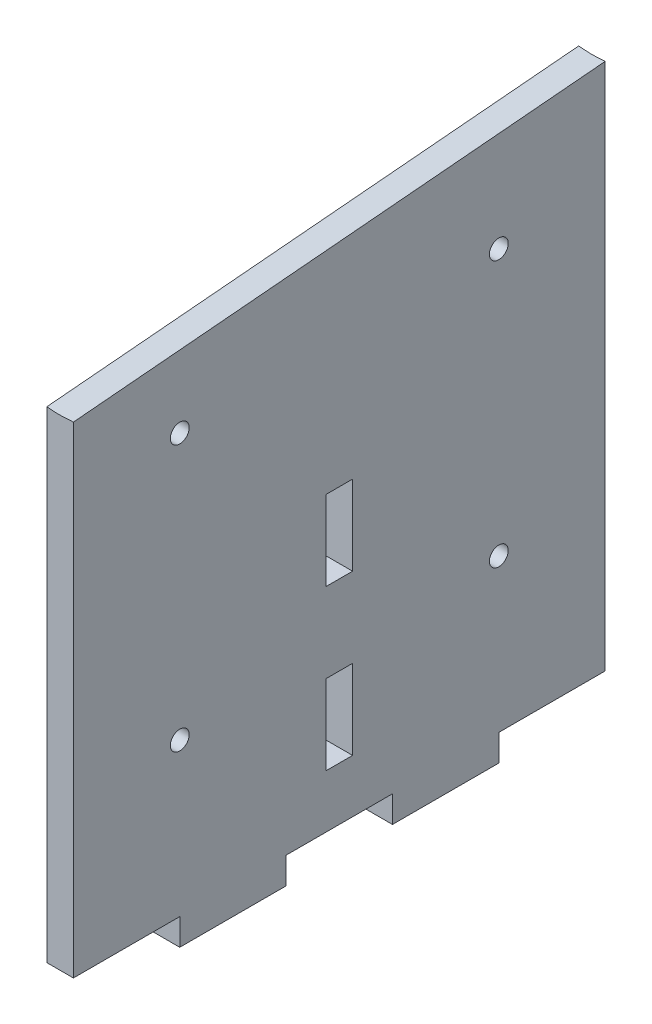
ISO-10303-21;
HEADER;
FILE_DESCRIPTION(('STEP AP214'),'2;1');
FILE_NAME('part.step','',(''),(''),'','','');
FILE_SCHEMA(('AUTOMOTIVE_DESIGN { 1 0 10303 214 1 1 1 1 }'));
ENDSEC;
DATA;
#1=APPLICATION_CONTEXT('core data for automotive mechanical design processes');
#2=APPLICATION_PROTOCOL_DEFINITION('international standard','automotive_design',2000,#1);
#3=PRODUCT_CONTEXT('',#1,'mechanical');
#4=PRODUCT('Part','Part','',(#3));
#5=PRODUCT_RELATED_PRODUCT_CATEGORY('part','',(#4));
#6=PRODUCT_DEFINITION_FORMATION('','',#4);
#7=PRODUCT_DEFINITION_CONTEXT('part definition',#1,'design');
#8=PRODUCT_DEFINITION('design','',#6,#7);
#9=PRODUCT_DEFINITION_SHAPE('','',#8);
#10=(LENGTH_UNIT() NAMED_UNIT(*) SI_UNIT(.MILLI.,.METRE.));
#11=(NAMED_UNIT(*) PLANE_ANGLE_UNIT() SI_UNIT($,.RADIAN.));
#12=(NAMED_UNIT(*) SI_UNIT($,.STERADIAN.) SOLID_ANGLE_UNIT());
#13=UNCERTAINTY_MEASURE_WITH_UNIT(LENGTH_MEASURE(1.E-05),#10,'distance_accuracy_value','');
#14=(GEOMETRIC_REPRESENTATION_CONTEXT(3) GLOBAL_UNCERTAINTY_ASSIGNED_CONTEXT((#13)) GLOBAL_UNIT_ASSIGNED_CONTEXT((#10,
#11,#12)) REPRESENTATION_CONTEXT('',''));
#15=CARTESIAN_POINT('',(0.,0.,0.));
#16=DIRECTION('',(0.,0.,1.));
#17=DIRECTION('',(1.,0.,0.));
#18=AXIS2_PLACEMENT_3D('',#15,#16,#17);
#19=CARTESIAN_POINT('',(0.,0.,0.));
#20=DIRECTION('',(0.,-1.,0.));
#21=DIRECTION('',(0.,0.,-1.));
#22=AXIS2_PLACEMENT_3D('',#19,#20,#21);
#23=PLANE('',#22);
#24=DIRECTION('',(1.,0.,0.));
#25=VECTOR('',#24,1.);
#26=CARTESIAN_POINT('',(0.,0.,-81.28));
#27=LINE('',#26,#25);
#28=CARTESIAN_POINT('',(0.,0.,-81.28));
#29=VERTEX_POINT('',#28);
#30=CARTESIAN_POINT('',(5.08,0.,-81.2799999999999));
#31=VERTEX_POINT('',#30);
#32=EDGE_CURVE('E257',#29,#31,#27,.T.);
#33=ORIENTED_EDGE('',*,*,#32,.T.);
#34=DIRECTION('',(0.,0.,-1.));
#35=VECTOR('',#34,1.);
#36=CARTESIAN_POINT('',(5.08,0.,0.));
#37=LINE('',#36,#35);
#38=CARTESIAN_POINT('',(5.08,0.,-60.96));
#39=VERTEX_POINT('',#38);
#40=EDGE_CURVE('E332',#39,#31,#37,.T.);
#41=ORIENTED_EDGE('',*,*,#40,.F.);
#42=DIRECTION('',(1.,0.,0.));
#43=VECTOR('',#42,1.);
#44=CARTESIAN_POINT('',(0.,0.,-60.96));
#45=LINE('',#44,#43);
#46=CARTESIAN_POINT('',(0.,0.,-60.96));
#47=VERTEX_POINT('',#46);
#48=EDGE_CURVE('E252',#47,#39,#45,.T.);
#49=ORIENTED_EDGE('',*,*,#48,.F.);
#50=DIRECTION('',(0.,0.,1.));
#51=VECTOR('',#50,1.);
#52=CARTESIAN_POINT('',(0.,0.,0.));
#53=LINE('',#52,#51);
#54=EDGE_CURVE('E331',#29,#47,#53,.T.);
#55=ORIENTED_EDGE('',*,*,#54,.F.);
#56=EDGE_LOOP('',(#33,#41,#49,#55));
#57=FACE_BOUND('',#56,.T.);
#58=ADVANCED_FACE('F32',(#57),#23,.T.);
#59=DIRECTION('',(1.,0.,0.));
#60=VECTOR('',#59,1.);
#61=CARTESIAN_POINT('',(0.,0.,-40.64));
#62=LINE('',#61,#60);
#63=CARTESIAN_POINT('',(0.,0.,-40.64));
#64=VERTEX_POINT('',#63);
#65=CARTESIAN_POINT('',(5.08,0.,-40.64));
#66=VERTEX_POINT('',#65);
#67=EDGE_CURVE('E279',#64,#66,#62,.T.);
#68=ORIENTED_EDGE('',*,*,#67,.T.);
#69=CARTESIAN_POINT('',(5.08,0.,-20.3199999999999));
#70=VERTEX_POINT('',#69);
#71=EDGE_CURVE('E335',#70,#66,#37,.T.);
#72=ORIENTED_EDGE('',*,*,#71,.F.);
#73=DIRECTION('',(1.,0.,0.));
#74=VECTOR('',#73,1.);
#75=CARTESIAN_POINT('',(0.,0.,-20.32));
#76=LINE('',#75,#74);
#77=CARTESIAN_POINT('',(0.,0.,-20.32));
#78=VERTEX_POINT('',#77);
#79=EDGE_CURVE('E274',#78,#70,#76,.T.);
#80=ORIENTED_EDGE('',*,*,#79,.F.);
#81=EDGE_CURVE('E323',#64,#78,#53,.T.);
#82=ORIENTED_EDGE('',*,*,#81,.F.);
#83=EDGE_LOOP('',(#68,#72,#80,#82));
#84=FACE_BOUND('',#83,.T.);
#85=ADVANCED_FACE('F390',(#84),#23,.T.);
#86=CARTESIAN_POINT('',(0.,163.833309497461,-101.6));
#87=DIRECTION('',(0.,0.,1.));
#88=DIRECTION('',(1.,0.,0.));
#89=AXIS2_PLACEMENT_3D('',#86,#87,#88);
#90=PLANE('',#89);
#91=DIRECTION('',(1.,0.,0.));
#92=VECTOR('',#91,1.);
#93=CARTESIAN_POINT('',(0.,5.08,-101.6));
#94=LINE('',#93,#92);
#95=CARTESIAN_POINT('',(0.,5.08,-101.6));
#96=VERTEX_POINT('',#95);
#97=CARTESIAN_POINT('',(5.08,5.08,-101.6));
#98=VERTEX_POINT('',#97);
#99=EDGE_CURVE('E254',#96,#98,#94,.T.);
#100=ORIENTED_EDGE('',*,*,#99,.F.);
#101=DIRECTION('',(0.,-1.,0.));
#102=VECTOR('',#101,1.);
#103=CARTESIAN_POINT('',(0.,163.833309497461,-101.6));
#104=LINE('',#103,#102);
#105=CARTESIAN_POINT('',(0.,105.948861844603,-101.6));
#106=VERTEX_POINT('',#105);
#107=EDGE_CURVE('E336',#106,#96,#104,.T.);
#108=ORIENTED_EDGE('',*,*,#107,.F.);
#109=CARTESIAN_POINT('',(2.53999999999923,130.933668617029,-101.6));
#110=DIRECTION('',(0.,0.,1.));
#111=DIRECTION('',(-2.45167675638666E-13,-1.,0.));
#112=AXIS2_PLACEMENT_3D('',#109,#110,#111);
#113=ELLIPSE('',#112,25.114568515497,25.019);
#114=CARTESIAN_POINT('',(5.08,105.948861844603,-101.6));
#115=VERTEX_POINT('',#114);
#116=EDGE_CURVE('E36',#106,#115,#113,.T.);
#117=ORIENTED_EDGE('',*,*,#116,.T.);
#118=DIRECTION('',(0.,-1.,0.));
#119=VECTOR('',#118,1.);
#120=CARTESIAN_POINT('',(5.08,163.833309497461,-101.6));
#121=LINE('',#120,#119);
#122=EDGE_CURVE('E339',#115,#98,#121,.T.);
#123=ORIENTED_EDGE('',*,*,#122,.T.);
#124=EDGE_LOOP('',(#100,#108,#117,#123));
#125=FACE_BOUND('',#124,.T.);
#126=ADVANCED_FACE('F352',(#125),#90,.F.);
#127=CARTESIAN_POINT('',(5.08,163.833309497461,0.));
#128=DIRECTION('',(-1.,0.,0.));
#129=DIRECTION('',(0.,0.,1.));
#130=AXIS2_PLACEMENT_3D('',#127,#128,#129);
#131=PLANE('',#130);
#132=DIRECTION('',(0.,0.,1.));
#133=VECTOR('',#132,1.);
#134=CARTESIAN_POINT('',(5.08,45.7200000000006,-53.3400000000007));
#135=LINE('',#134,#133);
#136=CARTESIAN_POINT('',(5.08,45.7200000000006,-53.3400000000007));
#137=VERTEX_POINT('',#136);
#138=CARTESIAN_POINT('',(5.08,45.7200000000006,-48.2600000000007));
#139=VERTEX_POINT('',#138);
#140=EDGE_CURVE('E183',#137,#139,#135,.T.);
#141=ORIENTED_EDGE('',*,*,#140,.T.);
#142=DIRECTION('',(0.,1.,0.));
#143=VECTOR('',#142,1.);
#144=CARTESIAN_POINT('',(5.08,45.7200000000006,-48.2600000000007));
#145=LINE('',#144,#143);
#146=CARTESIAN_POINT('',(5.08,60.9600000000006,-48.2600000000007));
#147=VERTEX_POINT('',#146);
#148=EDGE_CURVE('E175',#139,#147,#145,.T.);
#149=ORIENTED_EDGE('',*,*,#148,.T.);
#150=DIRECTION('',(0.,0.,-1.));
#151=VECTOR('',#150,1.);
#152=CARTESIAN_POINT('',(5.08,60.9600000000006,-48.2600000000007));
#153=LINE('',#152,#151);
#154=CARTESIAN_POINT('',(5.08,60.9600000000006,-53.3400000000007));
#155=VERTEX_POINT('',#154);
#156=EDGE_CURVE('E186',#147,#155,#153,.T.);
#157=ORIENTED_EDGE('',*,*,#156,.T.);
#158=DIRECTION('',(0.,-1.,0.));
#159=VECTOR('',#158,1.);
#160=CARTESIAN_POINT('',(5.08,60.9600000000006,-53.3400000000007));
#161=LINE('',#160,#159);
#162=EDGE_CURVE('E49',#155,#137,#161,.T.);
#163=ORIENTED_EDGE('',*,*,#162,.T.);
#164=EDGE_LOOP('',(#141,#149,#157,#163));
#165=FACE_BOUND('',#164,.T.);
#166=DIRECTION('',(0.,0.,1.));
#167=VECTOR('',#166,1.);
#168=CARTESIAN_POINT('',(5.08,15.2400000000006,-53.3400000000007));
#169=LINE('',#168,#167);
#170=CARTESIAN_POINT('',(5.08,15.2400000000006,-53.3400000000007));
#171=VERTEX_POINT('',#170);
#172=CARTESIAN_POINT('',(5.08,15.2400000000006,-48.2600000000007));
#173=VERTEX_POINT('',#172);
#174=EDGE_CURVE('E221',#171,#173,#169,.T.);
#175=ORIENTED_EDGE('',*,*,#174,.T.);
#176=DIRECTION('',(0.,1.,0.));
#177=VECTOR('',#176,1.);
#178=CARTESIAN_POINT('',(5.08,15.2400000000006,-48.2600000000007));
#179=LINE('',#178,#177);
#180=CARTESIAN_POINT('',(5.08,30.4800000000006,-48.2600000000007));
#181=VERTEX_POINT('',#180);
#182=EDGE_CURVE('E213',#173,#181,#179,.T.);
#183=ORIENTED_EDGE('',*,*,#182,.T.);
#184=DIRECTION('',(0.,0.,-1.));
#185=VECTOR('',#184,1.);
#186=CARTESIAN_POINT('',(5.08,30.4800000000006,-48.2600000000007));
#187=LINE('',#186,#185);
#188=CARTESIAN_POINT('',(5.08,30.4800000000006,-53.3400000000007));
#189=VERTEX_POINT('',#188);
#190=EDGE_CURVE('E216',#181,#189,#187,.T.);
#191=ORIENTED_EDGE('',*,*,#190,.T.);
#192=DIRECTION('',(0.,-1.,0.));
#193=VECTOR('',#192,1.);
#194=CARTESIAN_POINT('',(5.08,30.4800000000006,-53.3400000000007));
#195=LINE('',#194,#193);
#196=EDGE_CURVE('E57',#189,#171,#195,.T.);
#197=ORIENTED_EDGE('',*,*,#196,.T.);
#198=EDGE_LOOP('',(#175,#183,#191,#197));
#199=FACE_BOUND('',#198,.T.);
#200=CARTESIAN_POINT('',(5.08,34.2900000000003,-81.2800000000012));
#201=DIRECTION('',(1.,0.,0.));
#202=DIRECTION('',(0.,0.,-1.));
#203=AXIS2_PLACEMENT_3D('',#200,#201,#202);
#204=CIRCLE('',#203,1.79999999999999);
#205=CARTESIAN_POINT('',(5.08,34.2900000000003,-83.0800000000012));
#206=VERTEX_POINT('',#205);
#207=EDGE_CURVE('E317',#206,#206,#204,.T.);
#208=ORIENTED_EDGE('',*,*,#207,.F.);
#209=EDGE_LOOP('',(#208));
#210=FACE_BOUND('',#209,.T.);
#211=CARTESIAN_POINT('',(5.08,34.2900000000016,-20.3200000000017));
#212=DIRECTION('',(1.,0.,0.));
#213=DIRECTION('',(0.,0.,-1.));
#214=AXIS2_PLACEMENT_3D('',#211,#212,#213);
#215=CIRCLE('',#214,1.79999999999999);
#216=CARTESIAN_POINT('',(5.08,34.2900000000016,-22.1200000000017));
#217=VERTEX_POINT('',#216);
#218=EDGE_CURVE('E311',#217,#217,#215,.T.);
#219=ORIENTED_EDGE('',*,*,#218,.F.);
#220=EDGE_LOOP('',(#219));
#221=FACE_BOUND('',#220,.T.);
#222=CARTESIAN_POINT('',(5.08,85.0900000000016,-20.3200000000029));
#223=DIRECTION('',(1.,0.,0.));
#224=DIRECTION('',(0.,0.,-1.));
#225=AXIS2_PLACEMENT_3D('',#222,#223,#224);
#226=CIRCLE('',#225,1.79999999999998);
#227=CARTESIAN_POINT('',(5.08,85.0900000000016,-22.1200000000029));
#228=VERTEX_POINT('',#227);
#229=EDGE_CURVE('E305',#228,#228,#226,.T.);
#230=ORIENTED_EDGE('',*,*,#229,.F.);
#231=EDGE_LOOP('',(#230));
#232=FACE_BOUND('',#231,.T.);
#233=CARTESIAN_POINT('',(5.08,85.0900000000004,-81.2800000000029));
#234=DIRECTION('',(1.,0.,0.));
#235=DIRECTION('',(0.,0.,-1.));
#236=AXIS2_PLACEMENT_3D('',#233,#234,#235);
#237=CIRCLE('',#236,1.79999999999998);
#238=CARTESIAN_POINT('',(5.08,85.0900000000004,-83.0800000000029));
#239=VERTEX_POINT('',#238);
#240=EDGE_CURVE('E256',#239,#239,#237,.T.);
#241=ORIENTED_EDGE('',*,*,#240,.F.);
#242=EDGE_LOOP('',(#241));
#243=FACE_BOUND('',#242,.T.);
#244=DIRECTION('',(0.,0.,-1.));
#245=VECTOR('',#244,1.);
#246=CARTESIAN_POINT('',(5.08,5.08,0.));
#247=LINE('',#246,#245);
#248=CARTESIAN_POINT('',(5.08,5.08,-81.2799999999999));
#249=VERTEX_POINT('',#248);
#250=EDGE_CURVE('E249',#249,#98,#247,.T.);
#251=ORIENTED_EDGE('',*,*,#250,.T.);
#252=ORIENTED_EDGE('',*,*,#122,.F.);
#253=DIRECTION('',(0.,-0.0871557427476445,0.996194698091747));
#254=VECTOR('',#253,1.);
#255=CARTESIAN_POINT('',(5.08,114.113495251191,-194.922186870195));
#256=LINE('',#255,#254);
#257=CARTESIAN_POINT('',(5.07999999999582,97.0600136303701,0.));
#258=VERTEX_POINT('',#257);
#259=EDGE_CURVE('E324',#115,#258,#256,.T.);
#260=ORIENTED_EDGE('',*,*,#259,.T.);
#261=DIRECTION('',(0.,-1.,0.));
#262=VECTOR('',#261,1.);
#263=CARTESIAN_POINT('',(5.08,163.833309497461,0.));
#264=LINE('',#263,#262);
#265=CARTESIAN_POINT('',(5.08,5.08,0.));
#266=VERTEX_POINT('',#265);
#267=EDGE_CURVE('E342',#258,#266,#264,.T.);
#268=ORIENTED_EDGE('',*,*,#267,.T.);
#269=DIRECTION('',(0.,0.,-1.));
#270=VECTOR('',#269,1.);
#271=CARTESIAN_POINT('',(5.08,5.08,0.));
#272=LINE('',#271,#270);
#273=CARTESIAN_POINT('',(5.08,5.08,-20.3199999999999));
#274=VERTEX_POINT('',#273);
#275=EDGE_CURVE('E288',#266,#274,#272,.T.);
#276=ORIENTED_EDGE('',*,*,#275,.T.);
#277=DIRECTION('',(0.,-1.,0.));
#278=VECTOR('',#277,1.);
#279=CARTESIAN_POINT('',(5.08,0.,-20.3199999999999));
#280=LINE('',#279,#278);
#281=EDGE_CURVE('E209',#274,#70,#280,.T.);
#282=ORIENTED_EDGE('',*,*,#281,.T.);
#283=ORIENTED_EDGE('',*,*,#71,.T.);
#284=DIRECTION('',(0.,-1.,0.));
#285=VECTOR('',#284,1.);
#286=CARTESIAN_POINT('',(5.08,0.,-40.64));
#287=LINE('',#286,#285);
#288=CARTESIAN_POINT('',(5.08,5.08,-40.64));
#289=VERTEX_POINT('',#288);
#290=EDGE_CURVE('E264',#289,#66,#287,.T.);
#291=ORIENTED_EDGE('',*,*,#290,.F.);
#292=DIRECTION('',(0.,0.,-1.));
#293=VECTOR('',#292,1.);
#294=CARTESIAN_POINT('',(5.08,5.08,0.));
#295=LINE('',#294,#293);
#296=CARTESIAN_POINT('',(5.08,5.08,-60.96));
#297=VERTEX_POINT('',#296);
#298=EDGE_CURVE('E273',#289,#297,#295,.T.);
#299=ORIENTED_EDGE('',*,*,#298,.T.);
#300=DIRECTION('',(0.,-1.,0.));
#301=VECTOR('',#300,1.);
#302=CARTESIAN_POINT('',(5.08,0.,-60.96));
#303=LINE('',#302,#301);
#304=EDGE_CURVE('E270',#297,#39,#303,.T.);
#305=ORIENTED_EDGE('',*,*,#304,.T.);
#306=ORIENTED_EDGE('',*,*,#40,.T.);
#307=DIRECTION('',(0.,-1.,0.));
#308=VECTOR('',#307,1.);
#309=CARTESIAN_POINT('',(5.08,0.,-81.2799999999999));
#310=LINE('',#309,#308);
#311=EDGE_CURVE('E245',#249,#31,#310,.T.);
#312=ORIENTED_EDGE('',*,*,#311,.F.);
#313=EDGE_LOOP('',(#251,#252,#260,#268,#276,#282,#283,#291,#299,#305,#306,#312));
#314=FACE_BOUND('',#313,.T.);
#315=ADVANCED_FACE('F190',(#165,#199,#210,#221,#232,#243,#314),#131,.F.);
#316=CARTESIAN_POINT('',(0.,163.833309497461,0.));
#317=DIRECTION('',(0.,0.,-1.));
#318=DIRECTION('',(-1.,0.,0.));
#319=AXIS2_PLACEMENT_3D('',#316,#317,#318);
#320=PLANE('',#319);
#321=DIRECTION('',(1.,0.,0.));
#322=VECTOR('',#321,1.);
#323=CARTESIAN_POINT('',(0.,5.08,0.));
#324=LINE('',#323,#322);
#325=CARTESIAN_POINT('',(0.,5.08,0.));
#326=VERTEX_POINT('',#325);
#327=EDGE_CURVE('E296',#326,#266,#324,.T.);
#328=ORIENTED_EDGE('',*,*,#327,.T.);
#329=ORIENTED_EDGE('',*,*,#267,.F.);
#330=CARTESIAN_POINT('',(2.53999999999705,122.044820402796,0.));
#331=DIRECTION('',(0.,0.,-1.));
#332=DIRECTION('',(-2.45167675638666E-13,-1.,0.));
#333=AXIS2_PLACEMENT_3D('',#330,#331,#332);
#334=ELLIPSE('',#333,25.114568515497,25.019);
#335=CARTESIAN_POINT('',(0.,97.0600136303698,0.));
#336=VERTEX_POINT('',#335);
#337=EDGE_CURVE('E41',#258,#336,#334,.T.);
#338=ORIENTED_EDGE('',*,*,#337,.T.);
#339=DIRECTION('',(0.,-1.,0.));
#340=VECTOR('',#339,1.);
#341=CARTESIAN_POINT('',(0.,163.833309497461,0.));
#342=LINE('',#341,#340);
#343=EDGE_CURVE('E344',#336,#326,#342,.T.);
#344=ORIENTED_EDGE('',*,*,#343,.T.);
#345=EDGE_LOOP('',(#328,#329,#338,#344));
#346=FACE_BOUND('',#345,.T.);
#347=ADVANCED_FACE('F361',(#346),#320,.F.);
#348=CARTESIAN_POINT('',(0.,163.833309497461,0.));
#349=DIRECTION('',(1.,0.,0.));
#350=DIRECTION('',(0.,0.,-1.));
#351=AXIS2_PLACEMENT_3D('',#348,#349,#350);
#352=PLANE('',#351);
#353=DIRECTION('',(0.,0.,-1.));
#354=VECTOR('',#353,1.);
#355=CARTESIAN_POINT('',(0.,60.9600000000006,-48.2600000000007));
#356=LINE('',#355,#354);
#357=CARTESIAN_POINT('',(0.,60.9600000000006,-48.2600000000007));
#358=VERTEX_POINT('',#357);
#359=CARTESIAN_POINT('',(0.,60.9600000000006,-53.3400000000007));
#360=VERTEX_POINT('',#359);
#361=EDGE_CURVE('E202',#358,#360,#356,.T.);
#362=ORIENTED_EDGE('',*,*,#361,.F.);
#363=DIRECTION('',(0.,1.,0.));
#364=VECTOR('',#363,1.);
#365=CARTESIAN_POINT('',(0.,45.7200000000006,-48.2600000000007));
#366=LINE('',#365,#364);
#367=CARTESIAN_POINT('',(0.,45.7200000000006,-48.2600000000007));
#368=VERTEX_POINT('',#367);
#369=EDGE_CURVE('E178',#368,#358,#366,.T.);
#370=ORIENTED_EDGE('',*,*,#369,.F.);
#371=DIRECTION('',(0.,0.,1.));
#372=VECTOR('',#371,1.);
#373=CARTESIAN_POINT('',(0.,45.7200000000006,-53.3400000000007));
#374=LINE('',#373,#372);
#375=CARTESIAN_POINT('',(0.,45.7200000000006,-53.3400000000007));
#376=VERTEX_POINT('',#375);
#377=EDGE_CURVE('E193',#376,#368,#374,.T.);
#378=ORIENTED_EDGE('',*,*,#377,.F.);
#379=DIRECTION('',(0.,-1.,0.));
#380=VECTOR('',#379,1.);
#381=CARTESIAN_POINT('',(0.,60.9600000000006,-53.3400000000007));
#382=LINE('',#381,#380);
#383=EDGE_CURVE('E196',#360,#376,#382,.T.);
#384=ORIENTED_EDGE('',*,*,#383,.F.);
#385=EDGE_LOOP('',(#362,#370,#378,#384));
#386=FACE_BOUND('',#385,.T.);
#387=DIRECTION('',(0.,0.,-1.));
#388=VECTOR('',#387,1.);
#389=CARTESIAN_POINT('',(0.,30.4800000000006,-48.2600000000007));
#390=LINE('',#389,#388);
#391=CARTESIAN_POINT('',(0.,30.4800000000006,-48.2600000000007));
#392=VERTEX_POINT('',#391);
#393=CARTESIAN_POINT('',(0.,30.4800000000006,-53.3400000000007));
#394=VERTEX_POINT('',#393);
#395=EDGE_CURVE('E227',#392,#394,#390,.T.);
#396=ORIENTED_EDGE('',*,*,#395,.F.);
#397=DIRECTION('',(0.,1.,0.));
#398=VECTOR('',#397,1.);
#399=CARTESIAN_POINT('',(0.,15.2400000000006,-48.2600000000007));
#400=LINE('',#399,#398);
#401=CARTESIAN_POINT('',(0.,15.2400000000006,-48.2600000000007));
#402=VERTEX_POINT('',#401);
#403=EDGE_CURVE('E225',#402,#392,#400,.T.);
#404=ORIENTED_EDGE('',*,*,#403,.F.);
#405=DIRECTION('',(0.,0.,1.));
#406=VECTOR('',#405,1.);
#407=CARTESIAN_POINT('',(0.,15.2400000000006,-53.3400000000007));
#408=LINE('',#407,#406);
#409=CARTESIAN_POINT('',(0.,15.2400000000006,-53.3400000000007));
#410=VERTEX_POINT('',#409);
#411=EDGE_CURVE('E217',#410,#402,#408,.T.);
#412=ORIENTED_EDGE('',*,*,#411,.F.);
#413=DIRECTION('',(0.,-1.,0.));
#414=VECTOR('',#413,1.);
#415=CARTESIAN_POINT('',(0.,30.4800000000006,-53.3400000000007));
#416=LINE('',#415,#414);
#417=EDGE_CURVE('E230',#394,#410,#416,.T.);
#418=ORIENTED_EDGE('',*,*,#417,.F.);
#419=EDGE_LOOP('',(#396,#404,#412,#418));
#420=FACE_BOUND('',#419,.T.);
#421=CARTESIAN_POINT('',(0.,34.2900000000003,-81.2800000000011));
#422=DIRECTION('',(1.,0.,0.));
#423=DIRECTION('',(0.,0.,-1.));
#424=AXIS2_PLACEMENT_3D('',#421,#422,#423);
#425=CIRCLE('',#424,1.79999999999999);
#426=CARTESIAN_POINT('',(0.,34.2900000000003,-83.0800000000011));
#427=VERTEX_POINT('',#426);
#428=EDGE_CURVE('E320',#427,#427,#425,.T.);
#429=ORIENTED_EDGE('',*,*,#428,.T.);
#430=EDGE_LOOP('',(#429));
#431=FACE_BOUND('',#430,.T.);
#432=CARTESIAN_POINT('',(0.,34.2900000000016,-20.3200000000018));
#433=DIRECTION('',(1.,0.,0.));
#434=DIRECTION('',(0.,0.,-1.));
#435=AXIS2_PLACEMENT_3D('',#432,#433,#434);
#436=CIRCLE('',#435,1.79999999999999);
#437=CARTESIAN_POINT('',(0.,34.2900000000016,-22.1200000000018));
#438=VERTEX_POINT('',#437);
#439=EDGE_CURVE('E314',#438,#438,#436,.T.);
#440=ORIENTED_EDGE('',*,*,#439,.T.);
#441=EDGE_LOOP('',(#440));
#442=FACE_BOUND('',#441,.T.);
#443=CARTESIAN_POINT('',(0.,85.0900000000016,-20.3200000000029));
#444=DIRECTION('',(1.,0.,0.));
#445=DIRECTION('',(0.,0.,-1.));
#446=AXIS2_PLACEMENT_3D('',#443,#444,#445);
#447=CIRCLE('',#446,1.79999999999999);
#448=CARTESIAN_POINT('',(0.,85.0900000000016,-22.1200000000029));
#449=VERTEX_POINT('',#448);
#450=EDGE_CURVE('E308',#449,#449,#447,.T.);
#451=ORIENTED_EDGE('',*,*,#450,.T.);
#452=EDGE_LOOP('',(#451));
#453=FACE_BOUND('',#452,.T.);
#454=CARTESIAN_POINT('',(0.,85.0900000000004,-81.2800000000028));
#455=DIRECTION('',(1.,0.,0.));
#456=DIRECTION('',(0.,0.,-1.));
#457=AXIS2_PLACEMENT_3D('',#454,#455,#456);
#458=CIRCLE('',#457,1.79999999999999);
#459=CARTESIAN_POINT('',(0.,85.0900000000004,-83.0800000000028));
#460=VERTEX_POINT('',#459);
#461=EDGE_CURVE('E302',#460,#460,#458,.T.);
#462=ORIENTED_EDGE('',*,*,#461,.T.);
#463=EDGE_LOOP('',(#462));
#464=FACE_BOUND('',#463,.T.);
#465=DIRECTION('',(0.,0.,-1.));
#466=VECTOR('',#465,1.);
#467=CARTESIAN_POINT('',(0.,5.08,0.));
#468=LINE('',#467,#466);
#469=CARTESIAN_POINT('',(0.,5.08,-81.28));
#470=VERTEX_POINT('',#469);
#471=EDGE_CURVE('E242',#470,#96,#468,.T.);
#472=ORIENTED_EDGE('',*,*,#471,.F.);
#473=DIRECTION('',(0.,-1.,0.));
#474=VECTOR('',#473,1.);
#475=CARTESIAN_POINT('',(0.,0.,-81.28));
#476=LINE('',#475,#474);
#477=EDGE_CURVE('E244',#470,#29,#476,.T.);
#478=ORIENTED_EDGE('',*,*,#477,.T.);
#479=ORIENTED_EDGE('',*,*,#54,.T.);
#480=DIRECTION('',(0.,-1.,0.));
#481=VECTOR('',#480,1.);
#482=CARTESIAN_POINT('',(0.,0.,-60.96));
#483=LINE('',#482,#481);
#484=CARTESIAN_POINT('',(0.,5.08,-60.96));
#485=VERTEX_POINT('',#484);
#486=EDGE_CURVE('E261',#485,#47,#483,.T.);
#487=ORIENTED_EDGE('',*,*,#486,.F.);
#488=DIRECTION('',(0.,0.,-1.));
#489=VECTOR('',#488,1.);
#490=CARTESIAN_POINT('',(0.,5.08,0.));
#491=LINE('',#490,#489);
#492=CARTESIAN_POINT('',(0.,5.08,-40.64));
#493=VERTEX_POINT('',#492);
#494=EDGE_CURVE('E263',#493,#485,#491,.T.);
#495=ORIENTED_EDGE('',*,*,#494,.F.);
#496=DIRECTION('',(0.,-1.,0.));
#497=VECTOR('',#496,1.);
#498=CARTESIAN_POINT('',(0.,0.,-40.64));
#499=LINE('',#498,#497);
#500=EDGE_CURVE('E266',#493,#64,#499,.T.);
#501=ORIENTED_EDGE('',*,*,#500,.T.);
#502=ORIENTED_EDGE('',*,*,#81,.T.);
#503=DIRECTION('',(0.,-1.,0.));
#504=VECTOR('',#503,1.);
#505=CARTESIAN_POINT('',(0.,0.,-20.32));
#506=LINE('',#505,#504);
#507=CARTESIAN_POINT('',(0.,5.08,-20.32));
#508=VERTEX_POINT('',#507);
#509=EDGE_CURVE('E285',#508,#78,#506,.T.);
#510=ORIENTED_EDGE('',*,*,#509,.F.);
#511=DIRECTION('',(0.,0.,-1.));
#512=VECTOR('',#511,1.);
#513=CARTESIAN_POINT('',(0.,5.08,0.));
#514=LINE('',#513,#512);
#515=EDGE_CURVE('E287',#326,#508,#514,.T.);
#516=ORIENTED_EDGE('',*,*,#515,.F.);
#517=ORIENTED_EDGE('',*,*,#343,.F.);
#518=DIRECTION('',(0.,-0.0871557427476445,0.996194698091747));
#519=VECTOR('',#518,1.);
#520=CARTESIAN_POINT('',(0.,114.113495251191,-194.922186870195));
#521=LINE('',#520,#519);
#522=EDGE_CURVE('E11',#336,#106,#521,.F.);
#523=ORIENTED_EDGE('',*,*,#522,.T.);
#524=ORIENTED_EDGE('',*,*,#107,.T.);
#525=EDGE_LOOP('',(#472,#478,#479,#487,#495,#501,#502,#510,#516,#517,#523,#524));
#526=FACE_BOUND('',#525,.T.);
#527=ADVANCED_FACE('F34',(#386,#420,#431,#442,#453,#464,#526),#352,.F.);
#528=CARTESIAN_POINT('',(2.54000000000118,138.908514345903,-192.7529037875));
#529=DIRECTION('',(0.,-0.0871557427476445,0.996194698091747));
#530=DIRECTION('',(1.,0.,0.));
#531=AXIS2_PLACEMENT_3D('',#528,#529,#530);
#532=CYLINDRICAL_SURFACE('',#531,25.019);
#533=ORIENTED_EDGE('',*,*,#337,.F.);
#534=ORIENTED_EDGE('',*,*,#259,.F.);
#535=ORIENTED_EDGE('',*,*,#116,.F.);
#536=ORIENTED_EDGE('',*,*,#522,.F.);
#537=EDGE_LOOP('',(#533,#534,#535,#536));
#538=FACE_BOUND('',#537,.T.);
#539=ADVANCED_FACE('F355',(#538),#532,.F.);
#540=CARTESIAN_POINT('',(5.08,34.2900000000003,-81.2800000000012));
#541=DIRECTION('',(1.,0.,0.));
#542=DIRECTION('',(0.,0.,-1.));
#543=AXIS2_PLACEMENT_3D('',#540,#541,#542);
#544=CYLINDRICAL_SURFACE('',#543,1.79999999999999);
#545=ORIENTED_EDGE('',*,*,#428,.F.);
#546=EDGE_LOOP('',(#545));
#547=FACE_BOUND('',#546,.T.);
#548=ORIENTED_EDGE('',*,*,#207,.T.);
#549=EDGE_LOOP('',(#548));
#550=FACE_BOUND('',#549,.T.);
#551=ADVANCED_FACE('F427',(#547,#550),#544,.F.);
#552=CARTESIAN_POINT('',(5.08,34.2900000000016,-20.3200000000017));
#553=DIRECTION('',(1.,0.,0.));
#554=DIRECTION('',(0.,0.,-1.));
#555=AXIS2_PLACEMENT_3D('',#552,#553,#554);
#556=CYLINDRICAL_SURFACE('',#555,1.79999999999999);
#557=ORIENTED_EDGE('',*,*,#439,.F.);
#558=EDGE_LOOP('',(#557));
#559=FACE_BOUND('',#558,.T.);
#560=ORIENTED_EDGE('',*,*,#218,.T.);
#561=EDGE_LOOP('',(#560));
#562=FACE_BOUND('',#561,.T.);
#563=ADVANCED_FACE('F451',(#559,#562),#556,.F.);
#564=CARTESIAN_POINT('',(5.08,85.0900000000016,-20.3200000000029));
#565=DIRECTION('',(1.,0.,0.));
#566=DIRECTION('',(0.,0.,-1.));
#567=AXIS2_PLACEMENT_3D('',#564,#565,#566);
#568=CYLINDRICAL_SURFACE('',#567,1.79999999999999);
#569=ORIENTED_EDGE('',*,*,#450,.F.);
#570=EDGE_LOOP('',(#569));
#571=FACE_BOUND('',#570,.T.);
#572=ORIENTED_EDGE('',*,*,#229,.T.);
#573=EDGE_LOOP('',(#572));
#574=FACE_BOUND('',#573,.T.);
#575=ADVANCED_FACE('F444',(#571,#574),#568,.F.);
#576=CARTESIAN_POINT('',(5.08,85.0900000000004,-81.2800000000029));
#577=DIRECTION('',(1.,0.,0.));
#578=DIRECTION('',(0.,0.,-1.));
#579=AXIS2_PLACEMENT_3D('',#576,#577,#578);
#580=CYLINDRICAL_SURFACE('',#579,1.79999999999999);
#581=ORIENTED_EDGE('',*,*,#461,.F.);
#582=EDGE_LOOP('',(#581));
#583=FACE_BOUND('',#582,.T.);
#584=ORIENTED_EDGE('',*,*,#240,.T.);
#585=EDGE_LOOP('',(#584));
#586=FACE_BOUND('',#585,.T.);
#587=ADVANCED_FACE('F406',(#583,#586),#580,.F.);
#588=CARTESIAN_POINT('',(0.,0.,-20.32));
#589=DIRECTION('',(0.,0.,1.));
#590=DIRECTION('',(1.,0.,0.));
#591=AXIS2_PLACEMENT_3D('',#588,#589,#590);
#592=PLANE('',#591);
#593=ORIENTED_EDGE('',*,*,#281,.F.);
#594=DIRECTION('',(1.,0.,0.));
#595=VECTOR('',#594,1.);
#596=CARTESIAN_POINT('',(0.,5.08,-20.32));
#597=LINE('',#596,#595);
#598=EDGE_CURVE('E290',#508,#274,#597,.T.);
#599=ORIENTED_EDGE('',*,*,#598,.F.);
#600=ORIENTED_EDGE('',*,*,#509,.T.);
#601=ORIENTED_EDGE('',*,*,#79,.T.);
#602=EDGE_LOOP('',(#593,#599,#600,#601));
#603=FACE_BOUND('',#602,.T.);
#604=ADVANCED_FACE('F394',(#603),#592,.T.);
#605=CARTESIAN_POINT('',(0.,5.08,0.));
#606=DIRECTION('',(0.,-1.,0.));
#607=DIRECTION('',(0.,0.,-1.));
#608=AXIS2_PLACEMENT_3D('',#605,#606,#607);
#609=PLANE('',#608);
#610=ORIENTED_EDGE('',*,*,#275,.F.);
#611=ORIENTED_EDGE('',*,*,#327,.F.);
#612=ORIENTED_EDGE('',*,*,#515,.T.);
#613=ORIENTED_EDGE('',*,*,#598,.T.);
#614=EDGE_LOOP('',(#610,#611,#612,#613));
#615=FACE_BOUND('',#614,.T.);
#616=ADVANCED_FACE('F397',(#615),#609,.T.);
#617=CARTESIAN_POINT('',(0.,0.,-60.96));
#618=DIRECTION('',(0.,0.,1.));
#619=DIRECTION('',(1.,0.,0.));
#620=AXIS2_PLACEMENT_3D('',#617,#618,#619);
#621=PLANE('',#620);
#622=ORIENTED_EDGE('',*,*,#304,.F.);
#623=DIRECTION('',(1.,0.,0.));
#624=VECTOR('',#623,1.);
#625=CARTESIAN_POINT('',(0.,5.08,-60.96));
#626=LINE('',#625,#624);
#627=EDGE_CURVE('E269',#485,#297,#626,.T.);
#628=ORIENTED_EDGE('',*,*,#627,.F.);
#629=ORIENTED_EDGE('',*,*,#486,.T.);
#630=ORIENTED_EDGE('',*,*,#48,.T.);
#631=EDGE_LOOP('',(#622,#628,#629,#630));
#632=FACE_BOUND('',#631,.T.);
#633=ADVANCED_FACE('F377',(#632),#621,.T.);
#634=CARTESIAN_POINT('',(0.,0.,-40.64));
#635=DIRECTION('',(0.,0.,1.));
#636=DIRECTION('',(1.,0.,0.));
#637=AXIS2_PLACEMENT_3D('',#634,#635,#636);
#638=PLANE('',#637);
#639=ORIENTED_EDGE('',*,*,#290,.T.);
#640=ORIENTED_EDGE('',*,*,#67,.F.);
#641=ORIENTED_EDGE('',*,*,#500,.F.);
#642=DIRECTION('',(1.,0.,0.));
#643=VECTOR('',#642,1.);
#644=CARTESIAN_POINT('',(0.,5.08,-40.64));
#645=LINE('',#644,#643);
#646=EDGE_CURVE('E282',#493,#289,#645,.T.);
#647=ORIENTED_EDGE('',*,*,#646,.T.);
#648=EDGE_LOOP('',(#639,#640,#641,#647));
#649=FACE_BOUND('',#648,.T.);
#650=ADVANCED_FACE('F404',(#649),#638,.F.);
#651=CARTESIAN_POINT('',(0.,5.08,0.));
#652=DIRECTION('',(0.,-1.,0.));
#653=DIRECTION('',(0.,0.,-1.));
#654=AXIS2_PLACEMENT_3D('',#651,#652,#653);
#655=PLANE('',#654);
#656=ORIENTED_EDGE('',*,*,#298,.F.);
#657=ORIENTED_EDGE('',*,*,#646,.F.);
#658=ORIENTED_EDGE('',*,*,#494,.T.);
#659=ORIENTED_EDGE('',*,*,#627,.T.);
#660=EDGE_LOOP('',(#656,#657,#658,#659));
#661=FACE_BOUND('',#660,.T.);
#662=ADVANCED_FACE('F384',(#661),#655,.T.);
#663=CARTESIAN_POINT('',(0.,5.08,0.));
#664=DIRECTION('',(0.,-1.,0.));
#665=DIRECTION('',(0.,0.,-1.));
#666=AXIS2_PLACEMENT_3D('',#663,#664,#665);
#667=PLANE('',#666);
#668=ORIENTED_EDGE('',*,*,#250,.F.);
#669=DIRECTION('',(1.,0.,0.));
#670=VECTOR('',#669,1.);
#671=CARTESIAN_POINT('',(0.,5.08,-81.28));
#672=LINE('',#671,#670);
#673=EDGE_CURVE('E248',#470,#249,#672,.T.);
#674=ORIENTED_EDGE('',*,*,#673,.F.);
#675=ORIENTED_EDGE('',*,*,#471,.T.);
#676=ORIENTED_EDGE('',*,*,#99,.T.);
#677=EDGE_LOOP('',(#668,#674,#675,#676));
#678=FACE_BOUND('',#677,.T.);
#679=ADVANCED_FACE('F366',(#678),#667,.T.);
#680=CARTESIAN_POINT('',(0.,0.,-81.28));
#681=DIRECTION('',(0.,0.,1.));
#682=DIRECTION('',(1.,0.,0.));
#683=AXIS2_PLACEMENT_3D('',#680,#681,#682);
#684=PLANE('',#683);
#685=ORIENTED_EDGE('',*,*,#311,.T.);
#686=ORIENTED_EDGE('',*,*,#32,.F.);
#687=ORIENTED_EDGE('',*,*,#477,.F.);
#688=ORIENTED_EDGE('',*,*,#673,.T.);
#689=EDGE_LOOP('',(#685,#686,#687,#688));
#690=FACE_BOUND('',#689,.T.);
#691=ADVANCED_FACE('F529',(#690),#684,.F.);
#692=CARTESIAN_POINT('',(5.08,15.2400000000006,-48.2600000000007));
#693=DIRECTION('',(0.,0.,1.));
#694=DIRECTION('',(1.,0.,0.));
#695=AXIS2_PLACEMENT_3D('',#692,#693,#694);
#696=PLANE('',#695);
#697=ORIENTED_EDGE('',*,*,#403,.T.);
#698=DIRECTION('',(-1.,0.,0.));
#699=VECTOR('',#698,1.);
#700=CARTESIAN_POINT('',(5.08,30.4800000000006,-48.2600000000007));
#701=LINE('',#700,#699);
#702=EDGE_CURVE('E224',#181,#392,#701,.T.);
#703=ORIENTED_EDGE('',*,*,#702,.F.);
#704=ORIENTED_EDGE('',*,*,#182,.F.);
#705=DIRECTION('',(-1.,0.,0.));
#706=VECTOR('',#705,1.);
#707=CARTESIAN_POINT('',(5.08,15.2400000000006,-48.2600000000007));
#708=LINE('',#707,#706);
#709=EDGE_CURVE('E203',#173,#402,#708,.T.);
#710=ORIENTED_EDGE('',*,*,#709,.T.);
#711=EDGE_LOOP('',(#697,#703,#704,#710));
#712=FACE_BOUND('',#711,.T.);
#713=ADVANCED_FACE('F536',(#712),#696,.F.);
#714=CARTESIAN_POINT('',(5.08,15.2400000000006,-53.3400000000007));
#715=DIRECTION('',(0.,-1.,0.));
#716=DIRECTION('',(0.,0.,-1.));
#717=AXIS2_PLACEMENT_3D('',#714,#715,#716);
#718=PLANE('',#717);
#719=ORIENTED_EDGE('',*,*,#411,.T.);
#720=ORIENTED_EDGE('',*,*,#709,.F.);
#721=ORIENTED_EDGE('',*,*,#174,.F.);
#722=DIRECTION('',(-1.,0.,0.));
#723=VECTOR('',#722,1.);
#724=CARTESIAN_POINT('',(5.08,15.2400000000006,-53.3400000000007));
#725=LINE('',#724,#723);
#726=EDGE_CURVE('E236',#171,#410,#725,.T.);
#727=ORIENTED_EDGE('',*,*,#726,.T.);
#728=EDGE_LOOP('',(#719,#720,#721,#727));
#729=FACE_BOUND('',#728,.T.);
#730=ADVANCED_FACE('F543',(#729),#718,.F.);
#731=CARTESIAN_POINT('',(5.08,30.4800000000006,-53.3400000000007));
#732=DIRECTION('',(0.,0.,-1.));
#733=DIRECTION('',(-1.,0.,0.));
#734=AXIS2_PLACEMENT_3D('',#731,#732,#733);
#735=PLANE('',#734);
#736=ORIENTED_EDGE('',*,*,#417,.T.);
#737=ORIENTED_EDGE('',*,*,#726,.F.);
#738=ORIENTED_EDGE('',*,*,#196,.F.);
#739=DIRECTION('',(-1.,0.,0.));
#740=VECTOR('',#739,1.);
#741=CARTESIAN_POINT('',(5.08,30.4800000000006,-53.3400000000007));
#742=LINE('',#741,#740);
#743=EDGE_CURVE('E238',#189,#394,#742,.T.);
#744=ORIENTED_EDGE('',*,*,#743,.T.);
#745=EDGE_LOOP('',(#736,#737,#738,#744));
#746=FACE_BOUND('',#745,.T.);
#747=ADVANCED_FACE('F551',(#746),#735,.F.);
#748=CARTESIAN_POINT('',(5.08,30.4800000000006,-48.2600000000007));
#749=DIRECTION('',(0.,1.,0.));
#750=DIRECTION('',(0.,0.,1.));
#751=AXIS2_PLACEMENT_3D('',#748,#749,#750);
#752=PLANE('',#751);
#753=ORIENTED_EDGE('',*,*,#395,.T.);
#754=ORIENTED_EDGE('',*,*,#743,.F.);
#755=ORIENTED_EDGE('',*,*,#190,.F.);
#756=ORIENTED_EDGE('',*,*,#702,.T.);
#757=EDGE_LOOP('',(#753,#754,#755,#756));
#758=FACE_BOUND('',#757,.T.);
#759=ADVANCED_FACE('F559',(#758),#752,.F.);
#760=CARTESIAN_POINT('',(5.08,45.7200000000006,-48.2600000000007));
#761=DIRECTION('',(0.,0.,1.));
#762=DIRECTION('',(1.,0.,0.));
#763=AXIS2_PLACEMENT_3D('',#760,#761,#762);
#764=PLANE('',#763);
#765=ORIENTED_EDGE('',*,*,#369,.T.);
#766=DIRECTION('',(-1.,0.,0.));
#767=VECTOR('',#766,1.);
#768=CARTESIAN_POINT('',(5.08,60.9600000000006,-48.2600000000007));
#769=LINE('',#768,#767);
#770=EDGE_CURVE('E171',#147,#358,#769,.T.);
#771=ORIENTED_EDGE('',*,*,#770,.F.);
#772=ORIENTED_EDGE('',*,*,#148,.F.);
#773=DIRECTION('',(-1.,0.,0.));
#774=VECTOR('',#773,1.);
#775=CARTESIAN_POINT('',(5.08,45.7200000000006,-48.2600000000007));
#776=LINE('',#775,#774);
#777=EDGE_CURVE('E207',#139,#368,#776,.T.);
#778=ORIENTED_EDGE('',*,*,#777,.T.);
#779=EDGE_LOOP('',(#765,#771,#772,#778));
#780=FACE_BOUND('',#779,.T.);
#781=ADVANCED_FACE('F173',(#780),#764,.F.);
#782=CARTESIAN_POINT('',(5.08,45.7200000000006,-53.3400000000007));
#783=DIRECTION('',(0.,-1.,0.));
#784=DIRECTION('',(0.,0.,-1.));
#785=AXIS2_PLACEMENT_3D('',#782,#783,#784);
#786=PLANE('',#785);
#787=ORIENTED_EDGE('',*,*,#377,.T.);
#788=ORIENTED_EDGE('',*,*,#777,.F.);
#789=ORIENTED_EDGE('',*,*,#140,.F.);
#790=DIRECTION('',(-1.,0.,0.));
#791=VECTOR('',#790,1.);
#792=CARTESIAN_POINT('',(5.08,45.7200000000006,-53.3400000000007));
#793=LINE('',#792,#791);
#794=EDGE_CURVE('E210',#137,#376,#793,.T.);
#795=ORIENTED_EDGE('',*,*,#794,.T.);
#796=EDGE_LOOP('',(#787,#788,#789,#795));
#797=FACE_BOUND('',#796,.T.);
#798=ADVANCED_FACE('F573',(#797),#786,.F.);
#799=CARTESIAN_POINT('',(5.08,60.9600000000006,-53.3400000000007));
#800=DIRECTION('',(0.,0.,-1.));
#801=DIRECTION('',(-1.,0.,0.));
#802=AXIS2_PLACEMENT_3D('',#799,#800,#801);
#803=PLANE('',#802);
#804=ORIENTED_EDGE('',*,*,#383,.T.);
#805=ORIENTED_EDGE('',*,*,#794,.F.);
#806=ORIENTED_EDGE('',*,*,#162,.F.);
#807=DIRECTION('',(-1.,0.,0.));
#808=VECTOR('',#807,1.);
#809=CARTESIAN_POINT('',(5.08,60.9600000000006,-53.3400000000007));
#810=LINE('',#809,#808);
#811=EDGE_CURVE('E182',#155,#360,#810,.T.);
#812=ORIENTED_EDGE('',*,*,#811,.T.);
#813=EDGE_LOOP('',(#804,#805,#806,#812));
#814=FACE_BOUND('',#813,.T.);
#815=ADVANCED_FACE('F580',(#814),#803,.F.);
#816=CARTESIAN_POINT('',(5.08,60.9600000000006,-48.2600000000007));
#817=DIRECTION('',(0.,1.,0.));
#818=DIRECTION('',(0.,0.,1.));
#819=AXIS2_PLACEMENT_3D('',#816,#817,#818);
#820=PLANE('',#819);
#821=ORIENTED_EDGE('',*,*,#361,.T.);
#822=ORIENTED_EDGE('',*,*,#811,.F.);
#823=ORIENTED_EDGE('',*,*,#156,.F.);
#824=ORIENTED_EDGE('',*,*,#770,.T.);
#825=EDGE_LOOP('',(#821,#822,#823,#824));
#826=FACE_BOUND('',#825,.T.);
#827=ADVANCED_FACE('F187',(#826),#820,.F.);
#828=CLOSED_SHELL('',(#58,#85,#126,#315,#347,#527,#539,#551,#563,#575,#587,#604,#616,#633,#650,
#662,#679,#691,#713,#730,#747,#759,#781,#798,#815,#827));
#829=MANIFOLD_SOLID_BREP('B2',#828);
#830=ADVANCED_BREP_SHAPE_REPRESENTATION('',(#18,#829),#14);
#831=SHAPE_DEFINITION_REPRESENTATION(#9,#830);
ENDSEC;
END-ISO-10303-21;
